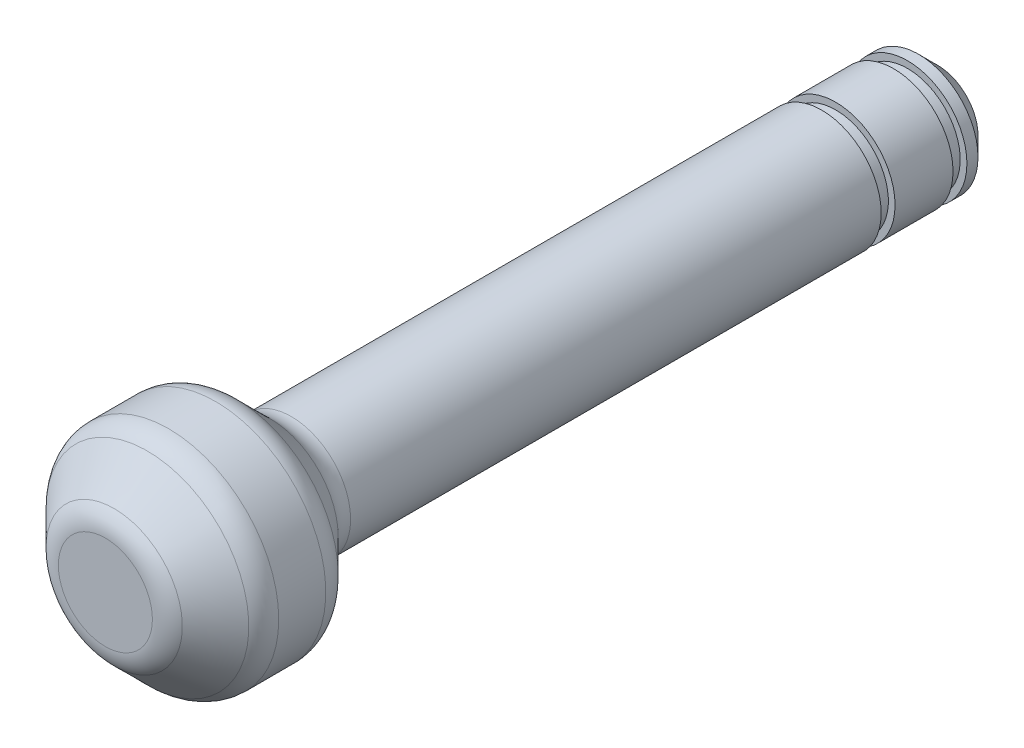
ISO-10303-21;
HEADER;
FILE_DESCRIPTION(('STEP AP214'),'2;1');
FILE_NAME('part.step','',(''),(''),'','','');
FILE_SCHEMA(('AUTOMOTIVE_DESIGN { 1 0 10303 214 1 1 1 1 }'));
ENDSEC;
DATA;
#1=APPLICATION_CONTEXT('core data for automotive mechanical design processes');
#2=APPLICATION_PROTOCOL_DEFINITION('international standard','automotive_design',2000,#1);
#3=PRODUCT_CONTEXT('',#1,'mechanical');
#4=PRODUCT('Part','Part','',(#3));
#5=PRODUCT_RELATED_PRODUCT_CATEGORY('part','',(#4));
#6=PRODUCT_DEFINITION_FORMATION('','',#4);
#7=PRODUCT_DEFINITION_CONTEXT('part definition',#1,'design');
#8=PRODUCT_DEFINITION('design','',#6,#7);
#9=PRODUCT_DEFINITION_SHAPE('','',#8);
#10=(LENGTH_UNIT() NAMED_UNIT(*) SI_UNIT(.MILLI.,.METRE.));
#11=(NAMED_UNIT(*) PLANE_ANGLE_UNIT() SI_UNIT($,.RADIAN.));
#12=(NAMED_UNIT(*) SI_UNIT($,.STERADIAN.) SOLID_ANGLE_UNIT());
#13=UNCERTAINTY_MEASURE_WITH_UNIT(LENGTH_MEASURE(1.E-05),#10,'distance_accuracy_value','');
#14=(GEOMETRIC_REPRESENTATION_CONTEXT(3) GLOBAL_UNCERTAINTY_ASSIGNED_CONTEXT((#13)) GLOBAL_UNIT_ASSIGNED_CONTEXT((#10,
#11,#12)) REPRESENTATION_CONTEXT('',''));
#15=CARTESIAN_POINT('',(0.,0.,0.));
#16=DIRECTION('',(0.,0.,1.));
#17=DIRECTION('',(1.,0.,0.));
#18=AXIS2_PLACEMENT_3D('',#15,#16,#17);
#19=CARTESIAN_POINT('',(0.,3.1496,-39.5224));
#20=DIRECTION('',(0.,0.,1.));
#21=DIRECTION('',(1.,0.,0.));
#22=AXIS2_PLACEMENT_3D('',#19,#20,#21);
#23=PLANE('',#22);
#24=CARTESIAN_POINT('',(0.,0.,-39.522399999953));
#25=DIRECTION('',(0.,0.,1.));
#26=DIRECTION('',(1.,0.,0.));
#27=AXIS2_PLACEMENT_3D('',#24,#25,#26);
#28=CIRCLE('',#27,2.14959999988196);
#29=CARTESIAN_POINT('',(2.14959999988196,0.,-39.522399999953));
#30=VERTEX_POINT('',#29);
#31=EDGE_CURVE('E49',#30,#30,#28,.T.);
#32=ORIENTED_EDGE('',*,*,#31,.F.);
#33=EDGE_LOOP('',(#32));
#34=FACE_BOUND('',#33,.T.);
#35=ADVANCED_FACE('F17',(#34),#23,.F.);
#36=CARTESIAN_POINT('',(0.,0.,-38.5223999999766));
#37=DIRECTION('',(0.,0.,1.));
#38=DIRECTION('',(1.,0.,0.));
#39=AXIS2_PLACEMENT_3D('',#36,#37,#38);
#40=CONICAL_SURFACE('',#39,3.14959999985831,0.785398163397448);
#41=ORIENTED_EDGE('',*,*,#31,.T.);
#42=EDGE_LOOP('',(#41));
#43=FACE_BOUND('',#42,.T.);
#44=CARTESIAN_POINT('',(0.,0.,-38.5224));
#45=DIRECTION('',(0.,0.,1.));
#46=DIRECTION('',(1.,0.,0.));
#47=AXIS2_PLACEMENT_3D('',#44,#45,#46);
#48=CIRCLE('',#47,3.1496);
#49=CARTESIAN_POINT('',(3.1496,0.,-38.5224));
#50=VERTEX_POINT('',#49);
#51=EDGE_CURVE('E47',#50,#50,#48,.T.);
#52=ORIENTED_EDGE('',*,*,#51,.F.);
#53=EDGE_LOOP('',(#52));
#54=FACE_BOUND('',#53,.T.);
#55=ADVANCED_FACE('F238',(#43,#54),#40,.T.);
#56=CARTESIAN_POINT('',(0.,0.,60.9008204406939));
#57=DIRECTION('',(0.,0.,1.));
#58=DIRECTION('',(1.,0.,0.));
#59=AXIS2_PLACEMENT_3D('',#56,#57,#58);
#60=CYLINDRICAL_SURFACE('',#59,3.1496);
#61=ORIENTED_EDGE('',*,*,#51,.T.);
#62=EDGE_LOOP('',(#61));
#63=FACE_BOUND('',#62,.T.);
#64=CARTESIAN_POINT('',(0.,0.,-37.9349));
#65=DIRECTION('',(0.,0.,1.));
#66=DIRECTION('',(1.,0.,0.));
#67=AXIS2_PLACEMENT_3D('',#64,#65,#66);
#68=CIRCLE('',#67,3.1496);
#69=CARTESIAN_POINT('',(3.1496,0.,-37.9349));
#70=VERTEX_POINT('',#69);
#71=EDGE_CURVE('E43',#70,#70,#68,.F.);
#72=ORIENTED_EDGE('',*,*,#71,.T.);
#73=EDGE_LOOP('',(#72));
#74=FACE_BOUND('',#73,.T.);
#75=ADVANCED_FACE('F230',(#63,#74),#60,.T.);
#76=CARTESIAN_POINT('',(0.,3.1496,4.59740000000003));
#77=DIRECTION('',(0.,0.,-1.));
#78=DIRECTION('',(-1.,0.,0.));
#79=AXIS2_PLACEMENT_3D('',#76,#77,#78);
#80=PLANE('',#79);
#81=CARTESIAN_POINT('',(0.,0.,4.59740000000003));
#82=DIRECTION('',(0.,0.,-1.));
#83=DIRECTION('',(-1.,0.,0.));
#84=AXIS2_PLACEMENT_3D('',#81,#82,#83);
#85=CIRCLE('',#84,2.4920359697327);
#86=CARTESIAN_POINT('',(-2.4920359697327,0.,4.59740000000003));
#87=VERTEX_POINT('',#86);
#88=CARTESIAN_POINT('',(2.4920359697327,0.,4.59740000000003));
#89=VERTEX_POINT('',#88);
#90=EDGE_CURVE('E37',#87,#89,#85,.T.);
#91=ORIENTED_EDGE('',*,*,#90,.F.);
#92=CARTESIAN_POINT('',(0.,0.,4.59740000000003));
#93=DIRECTION('',(0.,0.,-1.));
#94=DIRECTION('',(1.,0.,0.));
#95=AXIS2_PLACEMENT_3D('',#92,#93,#94);
#96=CIRCLE('',#95,2.4920359697327);
#97=EDGE_CURVE('E34',#89,#87,#96,.T.);
#98=ORIENTED_EDGE('',*,*,#97,.F.);
#99=EDGE_LOOP('',(#91,#98));
#100=FACE_BOUND('',#99,.T.);
#101=ADVANCED_FACE('F39',(#100),#80,.F.);
#102=CARTESIAN_POINT('',(0.,2.794,-37.9349));
#103=DIRECTION('',(0.,0.,-1.));
#104=DIRECTION('',(-1.,0.,0.));
#105=AXIS2_PLACEMENT_3D('',#102,#103,#104);
#106=PLANE('',#105);
#107=CARTESIAN_POINT('',(0.,0.,-37.9349));
#108=DIRECTION('',(0.,0.,-1.));
#109=DIRECTION('',(-1.,0.,0.));
#110=AXIS2_PLACEMENT_3D('',#107,#108,#109);
#111=CIRCLE('',#110,2.794);
#112=CARTESIAN_POINT('',(-2.794,0.,-37.9349));
#113=VERTEX_POINT('',#112);
#114=EDGE_CURVE('E42',#113,#113,#111,.F.);
#115=ORIENTED_EDGE('',*,*,#114,.F.);
#116=EDGE_LOOP('',(#115));
#117=FACE_BOUND('',#116,.T.);
#118=ORIENTED_EDGE('',*,*,#71,.F.);
#119=EDGE_LOOP('',(#118));
#120=FACE_BOUND('',#119,.T.);
#121=ADVANCED_FACE('F94',(#117,#120),#106,.F.);
#122=CARTESIAN_POINT('',(0.,0.,3.00990000000003));
#123=DIRECTION('',(0.,0.,-1.));
#124=DIRECTION('',(-1.,0.,0.));
#125=AXIS2_PLACEMENT_3D('',#122,#123,#124);
#126=TOROIDAL_SURFACE('',#125,2.4920359697327,1.5875);
#127=CARTESIAN_POINT('',(0.,0.,4.13243201518299));
#128=DIRECTION('',(0.,0.,-1.));
#129=DIRECTION('',(-1.,0.,0.));
#130=AXIS2_PLACEMENT_3D('',#127,#128,#129);
#131=CIRCLE('',#130,3.6145679848687);
#132=CARTESIAN_POINT('',(-3.6145679848687,0.,4.13243201518299));
#133=VERTEX_POINT('',#132);
#134=EDGE_CURVE('E56',#133,#133,#131,.T.);
#135=ORIENTED_EDGE('',*,*,#134,.F.);
#136=EDGE_LOOP('',(#135));
#137=FACE_BOUND('',#136,.T.);
#138=ORIENTED_EDGE('',*,*,#90,.T.);
#139=ORIENTED_EDGE('',*,*,#97,.T.);
#140=EDGE_LOOP('',(#138,#139));
#141=FACE_BOUND('',#140,.T.);
#142=ADVANCED_FACE('F46',(#137,#141),#126,.T.);
#143=CARTESIAN_POINT('',(0.,0.,-40.0654390361338));
#144=DIRECTION('',(0.,0.,-1.));
#145=DIRECTION('',(-1.,0.,0.));
#146=AXIS2_PLACEMENT_3D('',#143,#144,#145);
#147=CYLINDRICAL_SURFACE('',#146,2.794);
#148=ORIENTED_EDGE('',*,*,#114,.T.);
#149=EDGE_LOOP('',(#148));
#150=FACE_BOUND('',#149,.T.);
#151=CARTESIAN_POINT('',(0.,0.,-37.1983));
#152=DIRECTION('',(0.,0.,-1.));
#153=DIRECTION('',(-1.,0.,0.));
#154=AXIS2_PLACEMENT_3D('',#151,#152,#153);
#155=CIRCLE('',#154,2.794);
#156=CARTESIAN_POINT('',(-2.794,0.,-37.1983));
#157=VERTEX_POINT('',#156);
#158=EDGE_CURVE('E57',#157,#157,#155,.T.);
#159=ORIENTED_EDGE('',*,*,#158,.T.);
#160=EDGE_LOOP('',(#159));
#161=FACE_BOUND('',#160,.T.);
#162=ADVANCED_FACE('F93',(#150,#161),#147,.T.);
#163=CARTESIAN_POINT('',(0.,0.,2.36996798491873));
#164=DIRECTION('',(0.,0.,-1.));
#165=DIRECTION('',(-1.,0.,0.));
#166=AXIS2_PLACEMENT_3D('',#163,#164,#165);
#167=CONICAL_SURFACE('',#166,5.37703201513295,0.785398163381322);
#168=CARTESIAN_POINT('',(0.,0.,2.36996798486636));
#169=DIRECTION('',(0.,0.,-1.));
#170=DIRECTION('',(-1.,0.,0.));
#171=AXIS2_PLACEMENT_3D('',#168,#169,#170);
#172=CIRCLE('',#171,5.37703201513365);
#173=CARTESIAN_POINT('',(-5.37703201513365,0.,2.36996798486636));
#174=VERTEX_POINT('',#173);
#175=EDGE_CURVE('E60',#174,#174,#172,.T.);
#176=ORIENTED_EDGE('',*,*,#175,.F.);
#177=EDGE_LOOP('',(#176));
#178=FACE_BOUND('',#177,.T.);
#179=ORIENTED_EDGE('',*,*,#134,.T.);
#180=EDGE_LOOP('',(#179));
#181=FACE_BOUND('',#180,.T.);
#182=ADVANCED_FACE('F118',(#178,#181),#167,.T.);
#183=CARTESIAN_POINT('',(0.,2.794,-37.1983));
#184=DIRECTION('',(0.,0.,1.));
#185=DIRECTION('',(1.,0.,0.));
#186=AXIS2_PLACEMENT_3D('',#183,#184,#185);
#187=PLANE('',#186);
#188=CARTESIAN_POINT('',(0.,0.,-37.1983));
#189=DIRECTION('',(0.,0.,1.));
#190=DIRECTION('',(1.,0.,0.));
#191=AXIS2_PLACEMENT_3D('',#188,#189,#190);
#192=CIRCLE('',#191,3.1496);
#193=CARTESIAN_POINT('',(3.1496,0.,-37.1983));
#194=VERTEX_POINT('',#193);
#195=EDGE_CURVE('E61',#194,#194,#192,.T.);
#196=ORIENTED_EDGE('',*,*,#195,.F.);
#197=EDGE_LOOP('',(#196));
#198=FACE_BOUND('',#197,.T.);
#199=ORIENTED_EDGE('',*,*,#158,.F.);
#200=EDGE_LOOP('',(#199));
#201=FACE_BOUND('',#200,.T.);
#202=ADVANCED_FACE('F114',(#198,#201),#187,.F.);
#203=CARTESIAN_POINT('',(0.,0.,1.24743596973272));
#204=DIRECTION('',(0.,0.,-1.));
#205=DIRECTION('',(-1.,0.,0.));
#206=AXIS2_PLACEMENT_3D('',#203,#204,#205);
#207=TOROIDAL_SURFACE('',#206,4.2545,1.5875);
#208=CARTESIAN_POINT('',(0.,0.,1.24743596973272));
#209=DIRECTION('',(0.,0.,1.));
#210=DIRECTION('',(1.,0.,0.));
#211=AXIS2_PLACEMENT_3D('',#208,#209,#210);
#212=CIRCLE('',#211,5.842);
#213=CARTESIAN_POINT('',(5.842,0.,1.24743596973272));
#214=VERTEX_POINT('',#213);
#215=EDGE_CURVE('E64',#214,#214,#212,.F.);
#216=ORIENTED_EDGE('',*,*,#215,.F.);
#217=EDGE_LOOP('',(#216));
#218=FACE_BOUND('',#217,.T.);
#219=ORIENTED_EDGE('',*,*,#175,.T.);
#220=EDGE_LOOP('',(#219));
#221=FACE_BOUND('',#220,.T.);
#222=ADVANCED_FACE('F109',(#218,#221),#207,.T.);
#223=CARTESIAN_POINT('',(0.,0.,60.9008204406939));
#224=DIRECTION('',(0.,0.,1.));
#225=DIRECTION('',(1.,0.,0.));
#226=AXIS2_PLACEMENT_3D('',#223,#224,#225);
#227=CYLINDRICAL_SURFACE('',#226,3.1496);
#228=ORIENTED_EDGE('',*,*,#195,.T.);
#229=EDGE_LOOP('',(#228));
#230=FACE_BOUND('',#229,.T.);
#231=CARTESIAN_POINT('',(0.,0.,-34.1249));
#232=DIRECTION('',(0.,0.,1.));
#233=DIRECTION('',(1.,0.,0.));
#234=AXIS2_PLACEMENT_3D('',#231,#232,#233);
#235=CIRCLE('',#234,3.1496);
#236=CARTESIAN_POINT('',(3.1496,0.,-34.1249));
#237=VERTEX_POINT('',#236);
#238=EDGE_CURVE('E65',#237,#237,#235,.F.);
#239=ORIENTED_EDGE('',*,*,#238,.T.);
#240=EDGE_LOOP('',(#239));
#241=FACE_BOUND('',#240,.T.);
#242=ADVANCED_FACE('F113',(#230,#241),#227,.T.);
#243=CARTESIAN_POINT('',(0.,0.,60.9008204406939));
#244=DIRECTION('',(0.,0.,1.));
#245=DIRECTION('',(1.,0.,0.));
#246=AXIS2_PLACEMENT_3D('',#243,#244,#245);
#247=CYLINDRICAL_SURFACE('',#246,5.842);
#248=ORIENTED_EDGE('',*,*,#215,.T.);
#249=EDGE_LOOP('',(#248));
#250=FACE_BOUND('',#249,.T.);
#251=CARTESIAN_POINT('',(0.,0.,-1.24743596973272));
#252=DIRECTION('',(0.,0.,-1.));
#253=DIRECTION('',(-1.,0.,0.));
#254=AXIS2_PLACEMENT_3D('',#251,#252,#253);
#255=CIRCLE('',#254,5.842);
#256=CARTESIAN_POINT('',(-5.842,0.,-1.24743596973272));
#257=VERTEX_POINT('',#256);
#258=EDGE_CURVE('E68',#257,#257,#255,.T.);
#259=ORIENTED_EDGE('',*,*,#258,.F.);
#260=EDGE_LOOP('',(#259));
#261=FACE_BOUND('',#260,.T.);
#262=ADVANCED_FACE('F160',(#250,#261),#247,.T.);
#263=CARTESIAN_POINT('',(0.,3.1496,-34.1249));
#264=DIRECTION('',(0.,0.,-1.));
#265=DIRECTION('',(-1.,0.,0.));
#266=AXIS2_PLACEMENT_3D('',#263,#264,#265);
#267=PLANE('',#266);
#268=CARTESIAN_POINT('',(0.,0.,-34.1249));
#269=DIRECTION('',(0.,0.,-1.));
#270=DIRECTION('',(-1.,0.,0.));
#271=AXIS2_PLACEMENT_3D('',#268,#269,#270);
#272=CIRCLE('',#271,2.794);
#273=CARTESIAN_POINT('',(-2.794,0.,-34.1249));
#274=VERTEX_POINT('',#273);
#275=EDGE_CURVE('E69',#274,#274,#272,.F.);
#276=ORIENTED_EDGE('',*,*,#275,.F.);
#277=EDGE_LOOP('',(#276));
#278=FACE_BOUND('',#277,.T.);
#279=ORIENTED_EDGE('',*,*,#238,.F.);
#280=EDGE_LOOP('',(#279));
#281=FACE_BOUND('',#280,.T.);
#282=ADVANCED_FACE('F157',(#278,#281),#267,.F.);
#283=CARTESIAN_POINT('',(0.,0.,-1.24743596973272));
#284=DIRECTION('',(0.,0.,-1.));
#285=DIRECTION('',(-1.,0.,0.));
#286=AXIS2_PLACEMENT_3D('',#283,#284,#285);
#287=TOROIDAL_SURFACE('',#286,4.2545,1.5875);
#288=CARTESIAN_POINT('',(0.,0.,-2.36996798486189));
#289=DIRECTION('',(0.,0.,1.));
#290=DIRECTION('',(1.,0.,0.));
#291=AXIS2_PLACEMENT_3D('',#288,#289,#290);
#292=CIRCLE('',#291,5.37703201507611);
#293=CARTESIAN_POINT('',(5.37703201507611,0.,-2.36996798486189));
#294=VERTEX_POINT('',#293);
#295=EDGE_CURVE('E72',#294,#294,#292,.F.);
#296=ORIENTED_EDGE('',*,*,#295,.F.);
#297=EDGE_LOOP('',(#296));
#298=FACE_BOUND('',#297,.T.);
#299=ORIENTED_EDGE('',*,*,#258,.T.);
#300=EDGE_LOOP('',(#299));
#301=FACE_BOUND('',#300,.T.);
#302=ADVANCED_FACE('F152',(#298,#301),#287,.T.);
#303=CARTESIAN_POINT('',(0.,0.,-40.0654390361338));
#304=DIRECTION('',(0.,0.,-1.));
#305=DIRECTION('',(-1.,0.,0.));
#306=AXIS2_PLACEMENT_3D('',#303,#304,#305);
#307=CYLINDRICAL_SURFACE('',#306,2.794);
#308=ORIENTED_EDGE('',*,*,#275,.T.);
#309=EDGE_LOOP('',(#308));
#310=FACE_BOUND('',#309,.T.);
#311=CARTESIAN_POINT('',(0.,0.,-33.3883));
#312=DIRECTION('',(0.,0.,-1.));
#313=DIRECTION('',(-1.,0.,0.));
#314=AXIS2_PLACEMENT_3D('',#311,#312,#313);
#315=CIRCLE('',#314,2.794);
#316=CARTESIAN_POINT('',(-2.794,0.,-33.3883));
#317=VERTEX_POINT('',#316);
#318=EDGE_CURVE('E73',#317,#317,#315,.T.);
#319=ORIENTED_EDGE('',*,*,#318,.T.);
#320=EDGE_LOOP('',(#319));
#321=FACE_BOUND('',#320,.T.);
#322=ADVANCED_FACE('F156',(#310,#321),#307,.T.);
#323=CARTESIAN_POINT('',(0.,0.,-2.36996798486189));
#324=DIRECTION('',(0.,0.,1.));
#325=DIRECTION('',(1.,0.,0.));
#326=AXIS2_PLACEMENT_3D('',#323,#324,#325);
#327=CONICAL_SURFACE('',#326,5.37703201507611,0.785398163397448);
#328=ORIENTED_EDGE('',*,*,#295,.T.);
#329=EDGE_LOOP('',(#328));
#330=FACE_BOUND('',#329,.T.);
#331=CARTESIAN_POINT('',(0.,0.,-4.13243201513368));
#332=DIRECTION('',(0.,0.,1.));
#333=DIRECTION('',(1.,0.,0.));
#334=AXIS2_PLACEMENT_3D('',#331,#332,#333);
#335=CIRCLE('',#334,3.61456798486635);
#336=CARTESIAN_POINT('',(3.61456798486635,0.,-4.13243201513368));
#337=VERTEX_POINT('',#336);
#338=EDGE_CURVE('E76',#337,#337,#335,.T.);
#339=ORIENTED_EDGE('',*,*,#338,.T.);
#340=EDGE_LOOP('',(#339));
#341=FACE_BOUND('',#340,.T.);
#342=ADVANCED_FACE('F308',(#330,#341),#327,.T.);
#343=CARTESIAN_POINT('',(0.,3.1496,-33.3883));
#344=DIRECTION('',(0.,0.,1.));
#345=DIRECTION('',(1.,0.,0.));
#346=AXIS2_PLACEMENT_3D('',#343,#344,#345);
#347=PLANE('',#346);
#348=CARTESIAN_POINT('',(0.,0.,-33.3883));
#349=DIRECTION('',(0.,0.,1.));
#350=DIRECTION('',(1.,0.,0.));
#351=AXIS2_PLACEMENT_3D('',#348,#349,#350);
#352=CIRCLE('',#351,3.1496);
#353=CARTESIAN_POINT('',(3.1496,0.,-33.3883));
#354=VERTEX_POINT('',#353);
#355=EDGE_CURVE('E27',#354,#354,#352,.T.);
#356=ORIENTED_EDGE('',*,*,#355,.F.);
#357=EDGE_LOOP('',(#356));
#358=FACE_BOUND('',#357,.T.);
#359=ORIENTED_EDGE('',*,*,#318,.F.);
#360=EDGE_LOOP('',(#359));
#361=FACE_BOUND('',#360,.T.);
#362=ADVANCED_FACE('F137',(#358,#361),#347,.F.);
#363=CARTESIAN_POINT('',(0.,0.,-5.25496403026732));
#364=DIRECTION('',(0.,0.,1.));
#365=DIRECTION('',(1.,0.,0.));
#366=AXIS2_PLACEMENT_3D('',#363,#364,#365);
#367=TOROIDAL_SURFACE('',#366,4.7371,1.5875);
#368=ORIENTED_EDGE('',*,*,#338,.F.);
#369=EDGE_LOOP('',(#368));
#370=FACE_BOUND('',#369,.T.);
#371=CARTESIAN_POINT('',(0.,0.,-5.25496403026732));
#372=DIRECTION('',(0.,0.,1.));
#373=DIRECTION('',(1.,0.,0.));
#374=AXIS2_PLACEMENT_3D('',#371,#372,#373);
#375=CIRCLE('',#374,3.1496);
#376=CARTESIAN_POINT('',(3.1496,0.,-5.25496403026732));
#377=VERTEX_POINT('',#376);
#378=EDGE_CURVE('E11',#377,#377,#375,.F.);
#379=ORIENTED_EDGE('',*,*,#378,.F.);
#380=EDGE_LOOP('',(#379));
#381=FACE_BOUND('',#380,.T.);
#382=ADVANCED_FACE('F131',(#370,#381),#367,.F.);
#383=CARTESIAN_POINT('',(0.,0.,60.9008204406939));
#384=DIRECTION('',(0.,0.,1.));
#385=DIRECTION('',(1.,0.,0.));
#386=AXIS2_PLACEMENT_3D('',#383,#384,#385);
#387=CYLINDRICAL_SURFACE('',#386,3.1496);
#388=ORIENTED_EDGE('',*,*,#378,.T.);
#389=EDGE_LOOP('',(#388));
#390=FACE_BOUND('',#389,.T.);
#391=ORIENTED_EDGE('',*,*,#355,.T.);
#392=EDGE_LOOP('',(#391));
#393=FACE_BOUND('',#392,.T.);
#394=ADVANCED_FACE('F129',(#390,#393),#387,.T.);
#395=CLOSED_SHELL('',(#35,#55,#75,#101,#121,#142,#162,#182,#202,#222,#242,#262,#282,#302,#322,
#342,#362,#382,#394));
#396=MANIFOLD_SOLID_BREP('B1',#395);
#397=ADVANCED_BREP_SHAPE_REPRESENTATION('',(#18,#396),#14);
#398=SHAPE_DEFINITION_REPRESENTATION(#9,#397);
ENDSEC;
END-ISO-10303-21;
